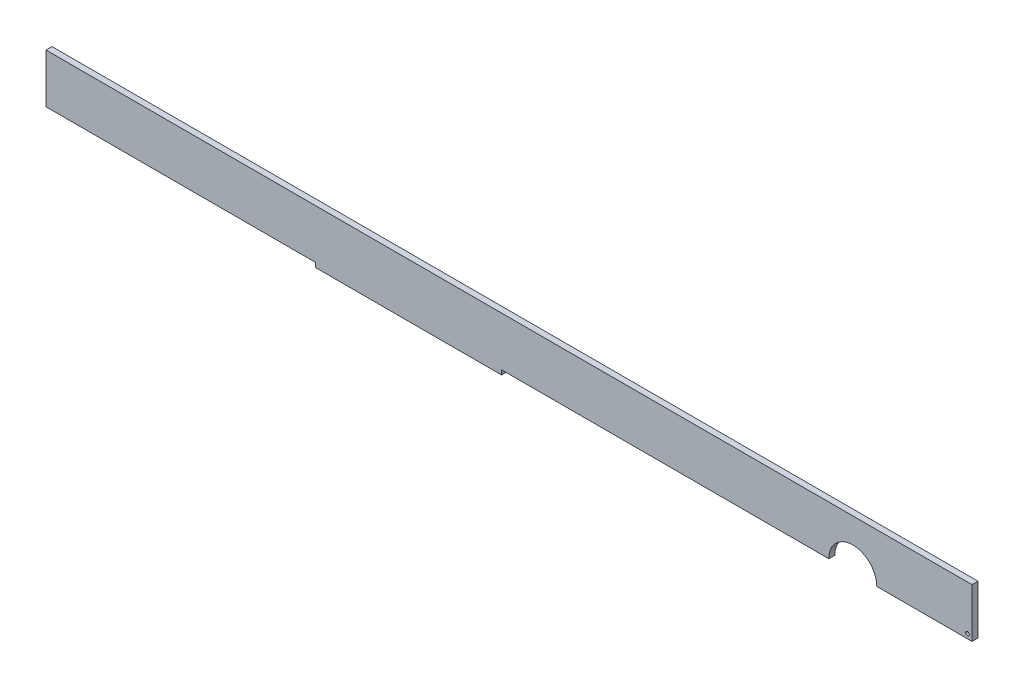
ISO-10303-21;
HEADER;
FILE_DESCRIPTION(('STEP AP214'),'2;1');
FILE_NAME('part.step','',(''),(''),'','','');
FILE_SCHEMA(('AUTOMOTIVE_DESIGN { 1 0 10303 214 1 1 1 1 }'));
ENDSEC;
DATA;
#1=APPLICATION_CONTEXT('core data for automotive mechanical design processes');
#2=APPLICATION_PROTOCOL_DEFINITION('international standard','automotive_design',2000,#1);
#3=PRODUCT_CONTEXT('',#1,'mechanical');
#4=PRODUCT('Part','Part','',(#3));
#5=PRODUCT_RELATED_PRODUCT_CATEGORY('part','',(#4));
#6=PRODUCT_DEFINITION_FORMATION('','',#4);
#7=PRODUCT_DEFINITION_CONTEXT('part definition',#1,'design');
#8=PRODUCT_DEFINITION('design','',#6,#7);
#9=PRODUCT_DEFINITION_SHAPE('','',#8);
#10=(LENGTH_UNIT() NAMED_UNIT(*) SI_UNIT(.MILLI.,.METRE.));
#11=(NAMED_UNIT(*) PLANE_ANGLE_UNIT() SI_UNIT($,.RADIAN.));
#12=(NAMED_UNIT(*) SI_UNIT($,.STERADIAN.) SOLID_ANGLE_UNIT());
#13=UNCERTAINTY_MEASURE_WITH_UNIT(LENGTH_MEASURE(1.E-05),#10,'distance_accuracy_value','');
#14=(GEOMETRIC_REPRESENTATION_CONTEXT(3) GLOBAL_UNCERTAINTY_ASSIGNED_CONTEXT((#13)) GLOBAL_UNIT_ASSIGNED_CONTEXT((#10,
#11,#12)) REPRESENTATION_CONTEXT('',''));
#15=CARTESIAN_POINT('',(0.,0.,0.));
#16=DIRECTION('',(0.,0.,1.));
#17=DIRECTION('',(1.,0.,0.));
#18=AXIS2_PLACEMENT_3D('',#15,#16,#17);
#19=CARTESIAN_POINT('',(31.,-8.19999999999996,2.));
#20=DIRECTION('',(0.,1.,0.));
#21=DIRECTION('',(0.,0.,1.));
#22=AXIS2_PLACEMENT_3D('',#19,#20,#21);
#23=PLANE('',#22);
#24=DIRECTION('',(1.,0.,0.));
#25=VECTOR('',#24,1.);
#26=CARTESIAN_POINT('',(31.,-8.19999999999996,2.));
#27=LINE('',#26,#25);
#28=CARTESIAN_POINT('',(156.220730503681,-8.19999999999996,2.));
#29=VERTEX_POINT('',#28);
#30=CARTESIAN_POINT('',(188.,-8.19999999999996,2.));
#31=VERTEX_POINT('',#30);
#32=EDGE_CURVE('E98',#29,#31,#27,.T.);
#33=ORIENTED_EDGE('',*,*,#32,.F.);
#34=DIRECTION('',(0.,0.,-1.));
#35=VECTOR('',#34,1.);
#36=CARTESIAN_POINT('',(156.220730503681,-8.19999999999996,2.));
#37=LINE('',#36,#35);
#38=CARTESIAN_POINT('',(156.220730503681,-8.19999999999996,0.));
#39=VERTEX_POINT('',#38);
#40=EDGE_CURVE('E198',#29,#39,#37,.T.);
#41=ORIENTED_EDGE('',*,*,#40,.T.);
#42=DIRECTION('',(1.,0.,0.));
#43=VECTOR('',#42,1.);
#44=CARTESIAN_POINT('',(31.,-8.19999999999996,0.));
#45=LINE('',#44,#43);
#46=CARTESIAN_POINT('',(188.,-8.19999999999996,0.));
#47=VERTEX_POINT('',#46);
#48=EDGE_CURVE('E146',#39,#47,#45,.T.);
#49=ORIENTED_EDGE('',*,*,#48,.T.);
#50=DIRECTION('',(0.,0.,-1.));
#51=VECTOR('',#50,1.);
#52=CARTESIAN_POINT('',(188.,-8.19999999999996,2.));
#53=LINE('',#52,#51);
#54=EDGE_CURVE('E11',#31,#47,#53,.T.);
#55=ORIENTED_EDGE('',*,*,#54,.F.);
#56=EDGE_LOOP('',(#33,#41,#49,#55));
#57=FACE_BOUND('',#56,.T.);
#58=ADVANCED_FACE('F33',(#57),#23,.F.);
#59=CARTESIAN_POINT('',(31.,-8.19999999999996,0.));
#60=VERTEX_POINT('',#59);
#61=CARTESIAN_POINT('',(140.220730503681,-8.19999999999996,0.));
#62=VERTEX_POINT('',#61);
#63=EDGE_CURVE('E142',#60,#62,#45,.T.);
#64=ORIENTED_EDGE('',*,*,#63,.T.);
#65=DIRECTION('',(0.,0.,-1.));
#66=VECTOR('',#65,1.);
#67=CARTESIAN_POINT('',(140.220730503681,-8.19999999999996,2.));
#68=LINE('',#67,#66);
#69=CARTESIAN_POINT('',(140.220730503681,-8.19999999999996,2.));
#70=VERTEX_POINT('',#69);
#71=EDGE_CURVE('E48',#62,#70,#68,.F.);
#72=ORIENTED_EDGE('',*,*,#71,.T.);
#73=CARTESIAN_POINT('',(31.,-8.19999999999996,2.));
#74=VERTEX_POINT('',#73);
#75=EDGE_CURVE('E196',#74,#70,#27,.T.);
#76=ORIENTED_EDGE('',*,*,#75,.F.);
#77=DIRECTION('',(0.,0.,-1.));
#78=VECTOR('',#77,1.);
#79=CARTESIAN_POINT('',(31.,-8.19999999999996,2.));
#80=LINE('',#79,#78);
#81=EDGE_CURVE('E138',#74,#60,#80,.T.);
#82=ORIENTED_EDGE('',*,*,#81,.T.);
#83=EDGE_LOOP('',(#64,#72,#76,#82));
#84=FACE_BOUND('',#83,.T.);
#85=ADVANCED_FACE('F35',(#84),#23,.F.);
#86=CARTESIAN_POINT('',(188.,8.20000000000003,2.));
#87=DIRECTION('',(-1.,0.,0.));
#88=DIRECTION('',(0.,0.,1.));
#89=AXIS2_PLACEMENT_3D('',#86,#87,#88);
#90=PLANE('',#89);
#91=DIRECTION('',(0.,1.,0.));
#92=VECTOR('',#91,1.);
#93=CARTESIAN_POINT('',(188.,8.20000000000003,0.));
#94=LINE('',#93,#92);
#95=CARTESIAN_POINT('',(188.,8.20000000000003,0.));
#96=VERTEX_POINT('',#95);
#97=EDGE_CURVE('E145',#47,#96,#94,.T.);
#98=ORIENTED_EDGE('',*,*,#97,.T.);
#99=DIRECTION('',(0.,0.,-1.));
#100=VECTOR('',#99,1.);
#101=CARTESIAN_POINT('',(188.,8.20000000000003,2.));
#102=LINE('',#101,#100);
#103=CARTESIAN_POINT('',(188.,8.20000000000003,2.));
#104=VERTEX_POINT('',#103);
#105=EDGE_CURVE('E41',#104,#96,#102,.T.);
#106=ORIENTED_EDGE('',*,*,#105,.F.);
#107=DIRECTION('',(0.,1.,0.));
#108=VECTOR('',#107,1.);
#109=CARTESIAN_POINT('',(188.,8.20000000000003,2.));
#110=LINE('',#109,#108);
#111=EDGE_CURVE('E177',#31,#104,#110,.T.);
#112=ORIENTED_EDGE('',*,*,#111,.F.);
#113=ORIENTED_EDGE('',*,*,#54,.T.);
#114=EDGE_LOOP('',(#98,#106,#112,#113));
#115=FACE_BOUND('',#114,.T.);
#116=ADVANCED_FACE('F176',(#115),#90,.F.);
#117=CARTESIAN_POINT('',(-110.999999999656,8.20000000000003,2.));
#118=DIRECTION('',(0.,-1.,0.));
#119=DIRECTION('',(0.,0.,-1.));
#120=AXIS2_PLACEMENT_3D('',#117,#118,#119);
#121=PLANE('',#120);
#122=DIRECTION('',(-1.,0.,0.));
#123=VECTOR('',#122,1.);
#124=CARTESIAN_POINT('',(-110.999999999656,8.20000000000003,0.));
#125=LINE('',#124,#123);
#126=CARTESIAN_POINT('',(-121.000000000144,8.20000000000003,0.));
#127=VERTEX_POINT('',#126);
#128=EDGE_CURVE('E149',#96,#127,#125,.T.);
#129=ORIENTED_EDGE('',*,*,#128,.T.);
#130=DIRECTION('',(0.,0.,-1.));
#131=VECTOR('',#130,1.);
#132=CARTESIAN_POINT('',(-121.000000000144,8.20000000000003,2.));
#133=LINE('',#132,#131);
#134=CARTESIAN_POINT('',(-121.000000000144,8.20000000000003,2.));
#135=VERTEX_POINT('',#134);
#136=EDGE_CURVE('E166',#135,#127,#133,.T.);
#137=ORIENTED_EDGE('',*,*,#136,.F.);
#138=DIRECTION('',(-1.,0.,0.));
#139=VECTOR('',#138,1.);
#140=CARTESIAN_POINT('',(-110.999999999656,8.20000000000003,2.));
#141=LINE('',#140,#139);
#142=EDGE_CURVE('E174',#104,#135,#141,.T.);
#143=ORIENTED_EDGE('',*,*,#142,.F.);
#144=ORIENTED_EDGE('',*,*,#105,.T.);
#145=EDGE_LOOP('',(#129,#137,#143,#144));
#146=FACE_BOUND('',#145,.T.);
#147=ADVANCED_FACE('F172',(#146),#121,.F.);
#148=CARTESIAN_POINT('',(-121.000000000144,8.20000000000003,2.));
#149=DIRECTION('',(1.,0.,0.));
#150=DIRECTION('',(0.,1.,0.));
#151=AXIS2_PLACEMENT_3D('',#148,#149,#150);
#152=PLANE('',#151);
#153=DIRECTION('',(0.,-1.,0.));
#154=VECTOR('',#153,1.);
#155=CARTESIAN_POINT('',(-121.000000000144,8.20000000000003,0.));
#156=LINE('',#155,#154);
#157=CARTESIAN_POINT('',(-121.000000000144,-8.19999999999997,0.));
#158=VERTEX_POINT('',#157);
#159=EDGE_CURVE('E151',#127,#158,#156,.T.);
#160=ORIENTED_EDGE('',*,*,#159,.T.);
#161=DIRECTION('',(0.,0.,-1.));
#162=VECTOR('',#161,1.);
#163=CARTESIAN_POINT('',(-121.000000000144,-8.19999999999997,2.));
#164=LINE('',#163,#162);
#165=CARTESIAN_POINT('',(-121.000000000144,-8.19999999999997,2.));
#166=VERTEX_POINT('',#165);
#167=EDGE_CURVE('E163',#166,#158,#164,.T.);
#168=ORIENTED_EDGE('',*,*,#167,.F.);
#169=DIRECTION('',(0.,-1.,0.));
#170=VECTOR('',#169,1.);
#171=CARTESIAN_POINT('',(-121.000000000144,8.20000000000003,2.));
#172=LINE('',#171,#170);
#173=EDGE_CURVE('E191',#135,#166,#172,.T.);
#174=ORIENTED_EDGE('',*,*,#173,.F.);
#175=ORIENTED_EDGE('',*,*,#136,.T.);
#176=EDGE_LOOP('',(#160,#168,#174,#175));
#177=FACE_BOUND('',#176,.T.);
#178=ADVANCED_FACE('F187',(#177),#152,.F.);
#179=CARTESIAN_POINT('',(-31.,-8.19999999999996,2.));
#180=DIRECTION('',(0.,1.,0.));
#181=DIRECTION('',(-1.,0.,0.));
#182=AXIS2_PLACEMENT_3D('',#179,#180,#181);
#183=PLANE('',#182);
#184=DIRECTION('',(1.,0.,0.));
#185=VECTOR('',#184,1.);
#186=CARTESIAN_POINT('',(-31.,-8.19999999999996,0.));
#187=LINE('',#186,#185);
#188=CARTESIAN_POINT('',(-31.,-8.19999999999996,0.));
#189=VERTEX_POINT('',#188);
#190=EDGE_CURVE('E154',#158,#189,#187,.T.);
#191=ORIENTED_EDGE('',*,*,#190,.T.);
#192=DIRECTION('',(0.,0.,-1.));
#193=VECTOR('',#192,1.);
#194=CARTESIAN_POINT('',(-31.,-8.19999999999996,2.));
#195=LINE('',#194,#193);
#196=CARTESIAN_POINT('',(-31.,-8.19999999999996,2.));
#197=VERTEX_POINT('',#196);
#198=EDGE_CURVE('E133',#197,#189,#195,.T.);
#199=ORIENTED_EDGE('',*,*,#198,.F.);
#200=DIRECTION('',(1.,0.,0.));
#201=VECTOR('',#200,1.);
#202=CARTESIAN_POINT('',(-110.999999999656,-8.19999999999997,2.));
#203=LINE('',#202,#201);
#204=EDGE_CURVE('E121',#166,#197,#203,.T.);
#205=ORIENTED_EDGE('',*,*,#204,.F.);
#206=ORIENTED_EDGE('',*,*,#167,.T.);
#207=EDGE_LOOP('',(#191,#199,#205,#206));
#208=FACE_BOUND('',#207,.T.);
#209=ADVANCED_FACE('F190',(#208),#183,.F.);
#210=CARTESIAN_POINT('',(-31.,-8.19999999999996,2.));
#211=DIRECTION('',(1.,0.,0.));
#212=DIRECTION('',(0.,0.,-1.));
#213=AXIS2_PLACEMENT_3D('',#210,#211,#212);
#214=PLANE('',#213);
#215=DIRECTION('',(0.,-1.,0.));
#216=VECTOR('',#215,1.);
#217=CARTESIAN_POINT('',(-31.,-8.19999999999996,0.));
#218=LINE('',#217,#216);
#219=CARTESIAN_POINT('',(-31.,-9.69999999999999,0.));
#220=VERTEX_POINT('',#219);
#221=EDGE_CURVE('E130',#189,#220,#218,.T.);
#222=ORIENTED_EDGE('',*,*,#221,.T.);
#223=DIRECTION('',(0.,0.,-1.));
#224=VECTOR('',#223,1.);
#225=CARTESIAN_POINT('',(-31.,-9.69999999999999,2.));
#226=LINE('',#225,#224);
#227=CARTESIAN_POINT('',(-31.,-9.69999999999999,2.));
#228=VERTEX_POINT('',#227);
#229=EDGE_CURVE('E127',#228,#220,#226,.T.);
#230=ORIENTED_EDGE('',*,*,#229,.F.);
#231=DIRECTION('',(0.,-1.,0.));
#232=VECTOR('',#231,1.);
#233=CARTESIAN_POINT('',(-31.,-8.19999999999996,2.));
#234=LINE('',#233,#232);
#235=EDGE_CURVE('E114',#197,#228,#234,.T.);
#236=ORIENTED_EDGE('',*,*,#235,.F.);
#237=ORIENTED_EDGE('',*,*,#198,.T.);
#238=EDGE_LOOP('',(#222,#230,#236,#237));
#239=FACE_BOUND('',#238,.T.);
#240=ADVANCED_FACE('F128',(#239),#214,.F.);
#241=CARTESIAN_POINT('',(31.,-9.69999999999997,2.));
#242=DIRECTION('',(0.,1.,0.));
#243=DIRECTION('',(-1.,0.,0.));
#244=AXIS2_PLACEMENT_3D('',#241,#242,#243);
#245=PLANE('',#244);
#246=DIRECTION('',(1.,0.,0.));
#247=VECTOR('',#246,1.);
#248=CARTESIAN_POINT('',(31.,-9.69999999999997,0.));
#249=LINE('',#248,#247);
#250=CARTESIAN_POINT('',(31.,-9.69999999999997,0.));
#251=VERTEX_POINT('',#250);
#252=EDGE_CURVE('E157',#220,#251,#249,.T.);
#253=ORIENTED_EDGE('',*,*,#252,.T.);
#254=DIRECTION('',(0.,0.,-1.));
#255=VECTOR('',#254,1.);
#256=CARTESIAN_POINT('',(31.,-9.69999999999997,2.));
#257=LINE('',#256,#255);
#258=CARTESIAN_POINT('',(31.,-9.69999999999997,2.));
#259=VERTEX_POINT('',#258);
#260=EDGE_CURVE('E134',#259,#251,#257,.T.);
#261=ORIENTED_EDGE('',*,*,#260,.F.);
#262=DIRECTION('',(1.,0.,0.));
#263=VECTOR('',#262,1.);
#264=CARTESIAN_POINT('',(31.,-9.69999999999997,2.));
#265=LINE('',#264,#263);
#266=EDGE_CURVE('E118',#228,#259,#265,.T.);
#267=ORIENTED_EDGE('',*,*,#266,.F.);
#268=ORIENTED_EDGE('',*,*,#229,.T.);
#269=EDGE_LOOP('',(#253,#261,#267,#268));
#270=FACE_BOUND('',#269,.T.);
#271=ADVANCED_FACE('F136',(#270),#245,.F.);
#272=CARTESIAN_POINT('',(31.,-8.19999999999996,2.));
#273=DIRECTION('',(-1.,0.,0.));
#274=DIRECTION('',(0.,0.,1.));
#275=AXIS2_PLACEMENT_3D('',#272,#273,#274);
#276=PLANE('',#275);
#277=DIRECTION('',(0.,1.,0.));
#278=VECTOR('',#277,1.);
#279=CARTESIAN_POINT('',(31.,-8.19999999999996,0.));
#280=LINE('',#279,#278);
#281=EDGE_CURVE('E90',#251,#60,#280,.T.);
#282=ORIENTED_EDGE('',*,*,#281,.T.);
#283=ORIENTED_EDGE('',*,*,#81,.F.);
#284=DIRECTION('',(0.,1.,0.));
#285=VECTOR('',#284,1.);
#286=CARTESIAN_POINT('',(31.,-8.19999999999996,2.));
#287=LINE('',#286,#285);
#288=EDGE_CURVE('E57',#259,#74,#287,.T.);
#289=ORIENTED_EDGE('',*,*,#288,.F.);
#290=ORIENTED_EDGE('',*,*,#260,.T.);
#291=EDGE_LOOP('',(#282,#283,#289,#290));
#292=FACE_BOUND('',#291,.T.);
#293=ADVANCED_FACE('F219',(#292),#276,.F.);
#294=CARTESIAN_POINT('',(0.,0.,2.));
#295=DIRECTION('',(0.,0.,-1.));
#296=DIRECTION('',(-1.,0.,0.));
#297=AXIS2_PLACEMENT_3D('',#294,#295,#296);
#298=PLANE('',#297);
#299=CARTESIAN_POINT('',(186.5,-6.69999999999995,2.));
#300=DIRECTION('',(0.,0.,-1.));
#301=DIRECTION('',(-1.,0.,0.));
#302=AXIS2_PLACEMENT_3D('',#299,#300,#301);
#303=CIRCLE('',#302,0.599999999999993);
#304=CARTESIAN_POINT('',(185.9,-6.69999999999995,2.));
#305=VERTEX_POINT('',#304);
#306=EDGE_CURVE('E202',#305,#305,#303,.T.);
#307=ORIENTED_EDGE('',*,*,#306,.T.);
#308=EDGE_LOOP('',(#307));
#309=FACE_BOUND('',#308,.T.);
#310=ORIENTED_EDGE('',*,*,#75,.T.);
#311=CARTESIAN_POINT('',(148.220730503681,-8.19999999999996,2.));
#312=DIRECTION('',(0.,0.,-1.));
#313=DIRECTION('',(-1.,0.,0.));
#314=AXIS2_PLACEMENT_3D('',#311,#312,#313);
#315=CIRCLE('',#314,7.99999999999998);
#316=EDGE_CURVE('E206',#70,#29,#315,.T.);
#317=ORIENTED_EDGE('',*,*,#316,.T.);
#318=ORIENTED_EDGE('',*,*,#32,.T.);
#319=ORIENTED_EDGE('',*,*,#111,.T.);
#320=ORIENTED_EDGE('',*,*,#142,.T.);
#321=ORIENTED_EDGE('',*,*,#173,.T.);
#322=ORIENTED_EDGE('',*,*,#204,.T.);
#323=ORIENTED_EDGE('',*,*,#235,.T.);
#324=ORIENTED_EDGE('',*,*,#266,.T.);
#325=ORIENTED_EDGE('',*,*,#288,.T.);
#326=EDGE_LOOP('',(#310,#317,#318,#319,#320,#321,#322,#323,#324,#325));
#327=FACE_BOUND('',#326,.T.);
#328=ADVANCED_FACE('F116',(#309,#327),#298,.F.);
#329=CARTESIAN_POINT('',(0.,0.,0.));
#330=DIRECTION('',(0.,0.,-1.));
#331=DIRECTION('',(-1.,0.,0.));
#332=AXIS2_PLACEMENT_3D('',#329,#330,#331);
#333=PLANE('',#332);
#334=CARTESIAN_POINT('',(148.220730503681,-8.19999999999996,0.));
#335=DIRECTION('',(0.,0.,-1.));
#336=DIRECTION('',(-1.,0.,0.));
#337=AXIS2_PLACEMENT_3D('',#334,#335,#336);
#338=CIRCLE('',#337,7.99999999999998);
#339=EDGE_CURVE('E209',#62,#39,#338,.T.);
#340=ORIENTED_EDGE('',*,*,#339,.F.);
#341=ORIENTED_EDGE('',*,*,#63,.F.);
#342=ORIENTED_EDGE('',*,*,#281,.F.);
#343=ORIENTED_EDGE('',*,*,#252,.F.);
#344=ORIENTED_EDGE('',*,*,#221,.F.);
#345=ORIENTED_EDGE('',*,*,#190,.F.);
#346=ORIENTED_EDGE('',*,*,#159,.F.);
#347=ORIENTED_EDGE('',*,*,#128,.F.);
#348=ORIENTED_EDGE('',*,*,#97,.F.);
#349=ORIENTED_EDGE('',*,*,#48,.F.);
#350=EDGE_LOOP('',(#340,#341,#342,#343,#344,#345,#346,#347,#348,#349));
#351=FACE_BOUND('',#350,.T.);
#352=CARTESIAN_POINT('',(186.5,-6.69999999999995,0.));
#353=DIRECTION('',(0.,0.,-1.));
#354=DIRECTION('',(-1.,0.,0.));
#355=AXIS2_PLACEMENT_3D('',#352,#353,#354);
#356=CIRCLE('',#355,0.599999999999993);
#357=CARTESIAN_POINT('',(185.9,-6.69999999999995,0.));
#358=VERTEX_POINT('',#357);
#359=EDGE_CURVE('E203',#358,#358,#356,.T.);
#360=ORIENTED_EDGE('',*,*,#359,.F.);
#361=EDGE_LOOP('',(#360));
#362=FACE_BOUND('',#361,.T.);
#363=ADVANCED_FACE('F182',(#351,#362),#333,.T.);
#364=CARTESIAN_POINT('',(186.5,-6.69999999999995,2.));
#365=DIRECTION('',(0.,0.,-1.));
#366=DIRECTION('',(-1.,0.,0.));
#367=AXIS2_PLACEMENT_3D('',#364,#365,#366);
#368=CYLINDRICAL_SURFACE('',#367,0.599999999999993);
#369=ORIENTED_EDGE('',*,*,#306,.F.);
#370=EDGE_LOOP('',(#369));
#371=FACE_BOUND('',#370,.T.);
#372=ORIENTED_EDGE('',*,*,#359,.T.);
#373=EDGE_LOOP('',(#372));
#374=FACE_BOUND('',#373,.T.);
#375=ADVANCED_FACE('F284',(#371,#374),#368,.F.);
#376=CARTESIAN_POINT('',(148.220730503681,-8.19999999999996,2.));
#377=DIRECTION('',(0.,0.,-1.));
#378=DIRECTION('',(-1.,0.,0.));
#379=AXIS2_PLACEMENT_3D('',#376,#377,#378);
#380=CYLINDRICAL_SURFACE('',#379,7.99999999999998);
#381=ORIENTED_EDGE('',*,*,#316,.F.);
#382=ORIENTED_EDGE('',*,*,#71,.F.);
#383=ORIENTED_EDGE('',*,*,#339,.T.);
#384=ORIENTED_EDGE('',*,*,#40,.F.);
#385=EDGE_LOOP('',(#381,#382,#383,#384));
#386=FACE_BOUND('',#385,.T.);
#387=ADVANCED_FACE('F216',(#386),#380,.F.);
#388=CLOSED_SHELL('',(#58,#85,#116,#147,#178,#209,#240,#271,#293,#328,#363,#375,#387));
#389=MANIFOLD_SOLID_BREP('B2',#388);
#390=ADVANCED_BREP_SHAPE_REPRESENTATION('',(#18,#389),#14);
#391=SHAPE_DEFINITION_REPRESENTATION(#9,#390);
ENDSEC;
END-ISO-10303-21;
